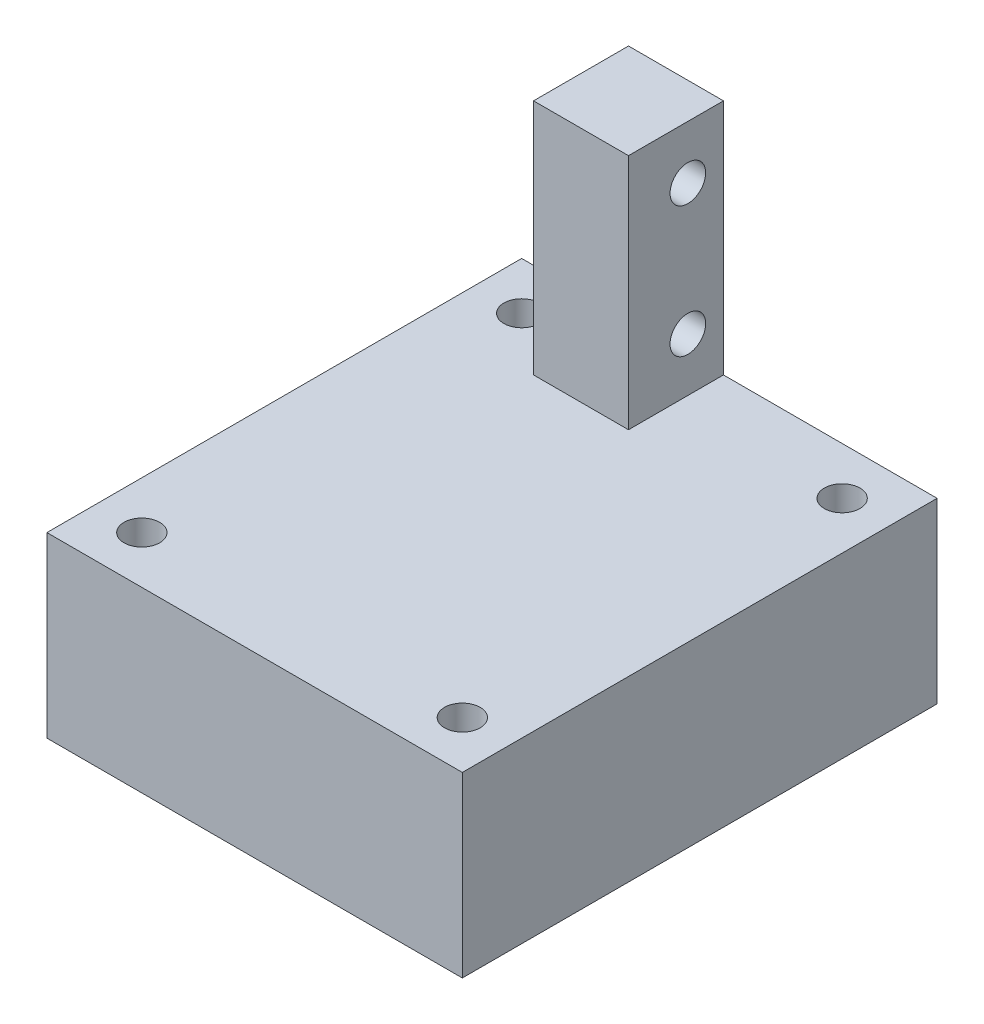
ISO-10303-21;
HEADER;
FILE_DESCRIPTION(('STEP AP214'),'2;1');
FILE_NAME('part.step','',(''),(''),'','','');
FILE_SCHEMA(('AUTOMOTIVE_DESIGN { 1 0 10303 214 1 1 1 1 }'));
ENDSEC;
DATA;
#1=APPLICATION_CONTEXT('core data for automotive mechanical design processes');
#2=APPLICATION_PROTOCOL_DEFINITION('international standard','automotive_design',2000,#1);
#3=PRODUCT_CONTEXT('',#1,'mechanical');
#4=PRODUCT('Part','Part','',(#3));
#5=PRODUCT_RELATED_PRODUCT_CATEGORY('part','',(#4));
#6=PRODUCT_DEFINITION_FORMATION('','',#4);
#7=PRODUCT_DEFINITION_CONTEXT('part definition',#1,'design');
#8=PRODUCT_DEFINITION('design','',#6,#7);
#9=PRODUCT_DEFINITION_SHAPE('','',#8);
#10=(LENGTH_UNIT() NAMED_UNIT(*) SI_UNIT(.MILLI.,.METRE.));
#11=(NAMED_UNIT(*) PLANE_ANGLE_UNIT() SI_UNIT($,.RADIAN.));
#12=(NAMED_UNIT(*) SI_UNIT($,.STERADIAN.) SOLID_ANGLE_UNIT());
#13=UNCERTAINTY_MEASURE_WITH_UNIT(LENGTH_MEASURE(1.E-05),#10,'distance_accuracy_value','');
#14=(GEOMETRIC_REPRESENTATION_CONTEXT(3) GLOBAL_UNCERTAINTY_ASSIGNED_CONTEXT((#13)) GLOBAL_UNIT_ASSIGNED_CONTEXT((#10,
#11,#12)) REPRESENTATION_CONTEXT('',''));
#15=CARTESIAN_POINT('',(0.,0.,0.));
#16=DIRECTION('',(0.,0.,1.));
#17=DIRECTION('',(1.,0.,0.));
#18=AXIS2_PLACEMENT_3D('',#15,#16,#17);
#19=CARTESIAN_POINT('',(0.,15.,0.));
#20=DIRECTION('',(0.,1.,0.));
#21=DIRECTION('',(0.,0.,1.));
#22=AXIS2_PLACEMENT_3D('',#19,#20,#21);
#23=PLANE('',#22);
#24=DIRECTION('',(0.,0.,1.));
#25=VECTOR('',#24,1.);
#26=CARTESIAN_POINT('',(-8.50000000000001,15.,-20.));
#27=LINE('',#26,#25);
#28=CARTESIAN_POINT('',(-8.50000000000001,15.,-20.));
#29=VERTEX_POINT('',#28);
#30=CARTESIAN_POINT('',(-8.50000000000001,15.,-12.));
#31=VERTEX_POINT('',#30);
#32=EDGE_CURVE('E62',#29,#31,#27,.T.);
#33=ORIENTED_EDGE('',*,*,#32,.F.);
#34=DIRECTION('',(-1.,0.,0.));
#35=VECTOR('',#34,1.);
#36=CARTESIAN_POINT('',(-17.5,15.,-20.));
#37=LINE('',#36,#35);
#38=CARTESIAN_POINT('',(-17.5,15.,-20.));
#39=VERTEX_POINT('',#38);
#40=EDGE_CURVE('E157',#29,#39,#37,.T.);
#41=ORIENTED_EDGE('',*,*,#40,.T.);
#42=DIRECTION('',(0.,0.,1.));
#43=VECTOR('',#42,1.);
#44=CARTESIAN_POINT('',(-17.5,15.,-20.));
#45=LINE('',#44,#43);
#46=CARTESIAN_POINT('',(-17.5,15.,20.));
#47=VERTEX_POINT('',#46);
#48=EDGE_CURVE('E162',#39,#47,#45,.T.);
#49=ORIENTED_EDGE('',*,*,#48,.T.);
#50=DIRECTION('',(1.,0.,0.));
#51=VECTOR('',#50,1.);
#52=CARTESIAN_POINT('',(-17.5,15.,20.));
#53=LINE('',#52,#51);
#54=CARTESIAN_POINT('',(17.5,15.,20.));
#55=VERTEX_POINT('',#54);
#56=EDGE_CURVE('E165',#47,#55,#53,.T.);
#57=ORIENTED_EDGE('',*,*,#56,.T.);
#58=DIRECTION('',(0.,0.,-1.));
#59=VECTOR('',#58,1.);
#60=CARTESIAN_POINT('',(17.5,15.,-20.));
#61=LINE('',#60,#59);
#62=CARTESIAN_POINT('',(17.5,15.,-20.));
#63=VERTEX_POINT('',#62);
#64=EDGE_CURVE('E153',#55,#63,#61,.T.);
#65=ORIENTED_EDGE('',*,*,#64,.T.);
#66=CARTESIAN_POINT('',(-0.500000000000007,15.,-20.));
#67=VERTEX_POINT('',#66);
#68=EDGE_CURVE('E159',#63,#67,#37,.T.);
#69=ORIENTED_EDGE('',*,*,#68,.T.);
#70=DIRECTION('',(0.,0.,-1.));
#71=VECTOR('',#70,1.);
#72=CARTESIAN_POINT('',(-0.500000000000007,15.,-20.));
#73=LINE('',#72,#71);
#74=CARTESIAN_POINT('',(-0.500000000000007,15.,-12.));
#75=VERTEX_POINT('',#74);
#76=EDGE_CURVE('E126',#75,#67,#73,.T.);
#77=ORIENTED_EDGE('',*,*,#76,.F.);
#78=DIRECTION('',(1.,0.,0.));
#79=VECTOR('',#78,1.);
#80=CARTESIAN_POINT('',(-8.50000000000001,15.,-12.));
#81=LINE('',#80,#79);
#82=EDGE_CURVE('E57',#31,#75,#81,.T.);
#83=ORIENTED_EDGE('',*,*,#82,.F.);
#84=EDGE_LOOP('',(#33,#41,#49,#57,#65,#69,#77,#83));
#85=FACE_BOUND('',#84,.T.);
#86=CARTESIAN_POINT('',(13.5,15.,-16.));
#87=DIRECTION('',(0.,1.,0.));
#88=DIRECTION('',(0.,0.,1.));
#89=AXIS2_PLACEMENT_3D('',#86,#87,#88);
#90=CIRCLE('',#89,1.50000000000001);
#91=CARTESIAN_POINT('',(13.5,15.,-14.5));
#92=VERTEX_POINT('',#91);
#93=EDGE_CURVE('E141',#92,#92,#90,.F.);
#94=ORIENTED_EDGE('',*,*,#93,.T.);
#95=EDGE_LOOP('',(#94));
#96=FACE_BOUND('',#95,.T.);
#97=CARTESIAN_POINT('',(-13.5,15.,-16.));
#98=DIRECTION('',(0.,1.,0.));
#99=DIRECTION('',(0.,0.,1.));
#100=AXIS2_PLACEMENT_3D('',#97,#98,#99);
#101=CIRCLE('',#100,1.50000000000001);
#102=CARTESIAN_POINT('',(-13.5,15.,-14.5));
#103=VERTEX_POINT('',#102);
#104=EDGE_CURVE('E145',#103,#103,#101,.F.);
#105=ORIENTED_EDGE('',*,*,#104,.T.);
#106=EDGE_LOOP('',(#105));
#107=FACE_BOUND('',#106,.T.);
#108=CARTESIAN_POINT('',(13.5,15.,16.));
#109=DIRECTION('',(0.,1.,0.));
#110=DIRECTION('',(0.,0.,1.));
#111=AXIS2_PLACEMENT_3D('',#108,#109,#110);
#112=CIRCLE('',#111,1.5);
#113=CARTESIAN_POINT('',(13.5,15.,17.5));
#114=VERTEX_POINT('',#113);
#115=EDGE_CURVE('E135',#114,#114,#112,.T.);
#116=ORIENTED_EDGE('',*,*,#115,.F.);
#117=EDGE_LOOP('',(#116));
#118=FACE_BOUND('',#117,.T.);
#119=CARTESIAN_POINT('',(-13.5,15.,16.));
#120=DIRECTION('',(0.,1.,0.));
#121=DIRECTION('',(0.,0.,1.));
#122=AXIS2_PLACEMENT_3D('',#119,#120,#121);
#123=CIRCLE('',#122,1.5);
#124=CARTESIAN_POINT('',(-13.5,15.,17.5));
#125=VERTEX_POINT('',#124);
#126=EDGE_CURVE('E130',#125,#125,#123,.T.);
#127=ORIENTED_EDGE('',*,*,#126,.F.);
#128=EDGE_LOOP('',(#127));
#129=FACE_BOUND('',#128,.T.);
#130=ADVANCED_FACE('F39',(#85,#96,#107,#118,#129),#23,.T.);
#131=CARTESIAN_POINT('',(0.,0.,0.));
#132=DIRECTION('',(0.,1.,0.));
#133=DIRECTION('',(0.,0.,1.));
#134=AXIS2_PLACEMENT_3D('',#131,#132,#133);
#135=PLANE('',#134);
#136=CARTESIAN_POINT('',(13.5,0.,16.));
#137=DIRECTION('',(0.,1.,0.));
#138=DIRECTION('',(0.,0.,1.));
#139=AXIS2_PLACEMENT_3D('',#136,#137,#138);
#140=CIRCLE('',#139,1.5);
#141=CARTESIAN_POINT('',(13.5,0.,17.5));
#142=VERTEX_POINT('',#141);
#143=EDGE_CURVE('E197',#142,#142,#140,.T.);
#144=ORIENTED_EDGE('',*,*,#143,.T.);
#145=EDGE_LOOP('',(#144));
#146=FACE_BOUND('',#145,.T.);
#147=CARTESIAN_POINT('',(13.5,0.,-16.));
#148=DIRECTION('',(0.,1.,0.));
#149=DIRECTION('',(0.,0.,1.));
#150=AXIS2_PLACEMENT_3D('',#147,#148,#149);
#151=CIRCLE('',#150,1.50000000000001);
#152=CARTESIAN_POINT('',(13.5,0.,-14.5));
#153=VERTEX_POINT('',#152);
#154=EDGE_CURVE('E194',#153,#153,#151,.F.);
#155=ORIENTED_EDGE('',*,*,#154,.F.);
#156=EDGE_LOOP('',(#155));
#157=FACE_BOUND('',#156,.T.);
#158=CARTESIAN_POINT('',(-13.5,0.,-16.));
#159=DIRECTION('',(0.,1.,0.));
#160=DIRECTION('',(0.,0.,1.));
#161=AXIS2_PLACEMENT_3D('',#158,#159,#160);
#162=CIRCLE('',#161,1.50000000000001);
#163=CARTESIAN_POINT('',(-13.5,0.,-14.5));
#164=VERTEX_POINT('',#163);
#165=EDGE_CURVE('E152',#164,#164,#162,.F.);
#166=ORIENTED_EDGE('',*,*,#165,.F.);
#167=EDGE_LOOP('',(#166));
#168=FACE_BOUND('',#167,.T.);
#169=DIRECTION('',(0.,0.,-1.));
#170=VECTOR('',#169,1.);
#171=CARTESIAN_POINT('',(17.5,0.,-20.));
#172=LINE('',#171,#170);
#173=CARTESIAN_POINT('',(17.5,0.,20.));
#174=VERTEX_POINT('',#173);
#175=CARTESIAN_POINT('',(17.5,0.,-20.));
#176=VERTEX_POINT('',#175);
#177=EDGE_CURVE('E169',#174,#176,#172,.T.);
#178=ORIENTED_EDGE('',*,*,#177,.F.);
#179=DIRECTION('',(1.,0.,0.));
#180=VECTOR('',#179,1.);
#181=CARTESIAN_POINT('',(-17.5,0.,20.));
#182=LINE('',#181,#180);
#183=CARTESIAN_POINT('',(-17.5,0.,20.));
#184=VERTEX_POINT('',#183);
#185=EDGE_CURVE('E158',#184,#174,#182,.T.);
#186=ORIENTED_EDGE('',*,*,#185,.F.);
#187=DIRECTION('',(0.,0.,1.));
#188=VECTOR('',#187,1.);
#189=CARTESIAN_POINT('',(-17.5,0.,-20.));
#190=LINE('',#189,#188);
#191=CARTESIAN_POINT('',(-17.5,0.,-20.));
#192=VERTEX_POINT('',#191);
#193=EDGE_CURVE('E176',#192,#184,#190,.T.);
#194=ORIENTED_EDGE('',*,*,#193,.F.);
#195=DIRECTION('',(-1.,0.,0.));
#196=VECTOR('',#195,1.);
#197=CARTESIAN_POINT('',(-17.5,0.,-20.));
#198=LINE('',#197,#196);
#199=EDGE_CURVE('E173',#176,#192,#198,.T.);
#200=ORIENTED_EDGE('',*,*,#199,.F.);
#201=EDGE_LOOP('',(#178,#186,#194,#200));
#202=FACE_BOUND('',#201,.T.);
#203=CARTESIAN_POINT('',(-13.5,0.,16.));
#204=DIRECTION('',(0.,1.,0.));
#205=DIRECTION('',(0.,0.,1.));
#206=AXIS2_PLACEMENT_3D('',#203,#204,#205);
#207=CIRCLE('',#206,1.5);
#208=CARTESIAN_POINT('',(-13.5,0.,17.5));
#209=VERTEX_POINT('',#208);
#210=EDGE_CURVE('E43',#209,#209,#207,.T.);
#211=ORIENTED_EDGE('',*,*,#210,.T.);
#212=EDGE_LOOP('',(#211));
#213=FACE_BOUND('',#212,.T.);
#214=ADVANCED_FACE('F206',(#146,#157,#168,#202,#213),#135,.F.);
#215=CARTESIAN_POINT('',(17.5,15.,-20.));
#216=DIRECTION('',(-1.,0.,0.));
#217=DIRECTION('',(0.,0.,1.));
#218=AXIS2_PLACEMENT_3D('',#215,#216,#217);
#219=PLANE('',#218);
#220=ORIENTED_EDGE('',*,*,#177,.T.);
#221=DIRECTION('',(0.,-1.,0.));
#222=VECTOR('',#221,1.);
#223=CARTESIAN_POINT('',(17.5,15.,-20.));
#224=LINE('',#223,#222);
#225=EDGE_CURVE('E11',#63,#176,#224,.T.);
#226=ORIENTED_EDGE('',*,*,#225,.F.);
#227=ORIENTED_EDGE('',*,*,#64,.F.);
#228=DIRECTION('',(0.,-1.,0.));
#229=VECTOR('',#228,1.);
#230=CARTESIAN_POINT('',(17.5,15.,20.));
#231=LINE('',#230,#229);
#232=EDGE_CURVE('E168',#55,#174,#231,.T.);
#233=ORIENTED_EDGE('',*,*,#232,.T.);
#234=EDGE_LOOP('',(#220,#226,#227,#233));
#235=FACE_BOUND('',#234,.T.);
#236=ADVANCED_FACE('F41',(#235),#219,.F.);
#237=CARTESIAN_POINT('',(-17.5,15.,-20.));
#238=DIRECTION('',(0.,0.,1.));
#239=DIRECTION('',(1.,0.,0.));
#240=AXIS2_PLACEMENT_3D('',#237,#238,#239);
#241=PLANE('',#240);
#242=ORIENTED_EDGE('',*,*,#199,.T.);
#243=DIRECTION('',(0.,-1.,0.));
#244=VECTOR('',#243,1.);
#245=CARTESIAN_POINT('',(-17.5,15.,-20.));
#246=LINE('',#245,#244);
#247=EDGE_CURVE('E49',#39,#192,#246,.T.);
#248=ORIENTED_EDGE('',*,*,#247,.F.);
#249=ORIENTED_EDGE('',*,*,#40,.F.);
#250=DIRECTION('',(0.,-1.,0.));
#251=VECTOR('',#250,1.);
#252=CARTESIAN_POINT('',(-8.50000000000001,35.,-20.));
#253=LINE('',#252,#251);
#254=CARTESIAN_POINT('',(-8.50000000000001,35.,-20.));
#255=VERTEX_POINT('',#254);
#256=EDGE_CURVE('E259',#255,#29,#253,.T.);
#257=ORIENTED_EDGE('',*,*,#256,.F.);
#258=DIRECTION('',(-1.,0.,0.));
#259=VECTOR('',#258,1.);
#260=CARTESIAN_POINT('',(-8.50000000000001,35.,-20.));
#261=LINE('',#260,#259);
#262=CARTESIAN_POINT('',(-0.500000000000007,35.,-20.));
#263=VERTEX_POINT('',#262);
#264=EDGE_CURVE('E121',#263,#255,#261,.T.);
#265=ORIENTED_EDGE('',*,*,#264,.F.);
#266=DIRECTION('',(0.,-1.,0.));
#267=VECTOR('',#266,1.);
#268=CARTESIAN_POINT('',(-0.500000000000007,35.,-20.));
#269=LINE('',#268,#267);
#270=EDGE_CURVE('E137',#263,#67,#269,.T.);
#271=ORIENTED_EDGE('',*,*,#270,.T.);
#272=ORIENTED_EDGE('',*,*,#68,.F.);
#273=ORIENTED_EDGE('',*,*,#225,.T.);
#274=EDGE_LOOP('',(#242,#248,#249,#257,#265,#271,#272,#273));
#275=FACE_BOUND('',#274,.T.);
#276=ADVANCED_FACE('F238',(#275),#241,.F.);
#277=CARTESIAN_POINT('',(-17.5,15.,-20.));
#278=DIRECTION('',(1.,0.,0.));
#279=DIRECTION('',(0.,0.,-1.));
#280=AXIS2_PLACEMENT_3D('',#277,#278,#279);
#281=PLANE('',#280);
#282=ORIENTED_EDGE('',*,*,#193,.T.);
#283=DIRECTION('',(0.,-1.,0.));
#284=VECTOR('',#283,1.);
#285=CARTESIAN_POINT('',(-17.5,15.,20.));
#286=LINE('',#285,#284);
#287=EDGE_CURVE('E184',#47,#184,#286,.T.);
#288=ORIENTED_EDGE('',*,*,#287,.F.);
#289=ORIENTED_EDGE('',*,*,#48,.F.);
#290=ORIENTED_EDGE('',*,*,#247,.T.);
#291=EDGE_LOOP('',(#282,#288,#289,#290));
#292=FACE_BOUND('',#291,.T.);
#293=ADVANCED_FACE('F235',(#292),#281,.F.);
#294=CARTESIAN_POINT('',(-17.5,15.,20.));
#295=DIRECTION('',(0.,0.,-1.));
#296=DIRECTION('',(-1.,0.,0.));
#297=AXIS2_PLACEMENT_3D('',#294,#295,#296);
#298=PLANE('',#297);
#299=ORIENTED_EDGE('',*,*,#185,.T.);
#300=ORIENTED_EDGE('',*,*,#232,.F.);
#301=ORIENTED_EDGE('',*,*,#56,.F.);
#302=ORIENTED_EDGE('',*,*,#287,.T.);
#303=EDGE_LOOP('',(#299,#300,#301,#302));
#304=FACE_BOUND('',#303,.T.);
#305=ADVANCED_FACE('F232',(#304),#298,.F.);
#306=CARTESIAN_POINT('',(-13.5,-10.,-16.));
#307=DIRECTION('',(0.,1.,0.));
#308=DIRECTION('',(0.,0.,1.));
#309=AXIS2_PLACEMENT_3D('',#306,#307,#308);
#310=CYLINDRICAL_SURFACE('',#309,1.50000000000001);
#311=ORIENTED_EDGE('',*,*,#104,.F.);
#312=EDGE_LOOP('',(#311));
#313=FACE_BOUND('',#312,.T.);
#314=ORIENTED_EDGE('',*,*,#165,.T.);
#315=EDGE_LOOP('',(#314));
#316=FACE_BOUND('',#315,.T.);
#317=ADVANCED_FACE('F230',(#313,#316),#310,.F.);
#318=CARTESIAN_POINT('',(13.5,-10.,-16.));
#319=DIRECTION('',(0.,1.,0.));
#320=DIRECTION('',(0.,0.,1.));
#321=AXIS2_PLACEMENT_3D('',#318,#319,#320);
#322=CYLINDRICAL_SURFACE('',#321,1.50000000000001);
#323=ORIENTED_EDGE('',*,*,#93,.F.);
#324=EDGE_LOOP('',(#323));
#325=FACE_BOUND('',#324,.T.);
#326=ORIENTED_EDGE('',*,*,#154,.T.);
#327=EDGE_LOOP('',(#326));
#328=FACE_BOUND('',#327,.T.);
#329=ADVANCED_FACE('F219',(#325,#328),#322,.F.);
#330=CARTESIAN_POINT('',(13.5,-10.,16.));
#331=DIRECTION('',(0.,1.,0.));
#332=DIRECTION('',(0.,0.,1.));
#333=AXIS2_PLACEMENT_3D('',#330,#331,#332);
#334=CYLINDRICAL_SURFACE('',#333,1.5);
#335=ORIENTED_EDGE('',*,*,#115,.T.);
#336=EDGE_LOOP('',(#335));
#337=FACE_BOUND('',#336,.T.);
#338=ORIENTED_EDGE('',*,*,#143,.F.);
#339=EDGE_LOOP('',(#338));
#340=FACE_BOUND('',#339,.T.);
#341=ADVANCED_FACE('F210',(#337,#340),#334,.F.);
#342=CARTESIAN_POINT('',(-13.5,-10.,16.));
#343=DIRECTION('',(0.,1.,0.));
#344=DIRECTION('',(0.,0.,1.));
#345=AXIS2_PLACEMENT_3D('',#342,#343,#344);
#346=CYLINDRICAL_SURFACE('',#345,1.5);
#347=ORIENTED_EDGE('',*,*,#126,.T.);
#348=EDGE_LOOP('',(#347));
#349=FACE_BOUND('',#348,.T.);
#350=ORIENTED_EDGE('',*,*,#210,.F.);
#351=EDGE_LOOP('',(#350));
#352=FACE_BOUND('',#351,.T.);
#353=ADVANCED_FACE('F208',(#349,#352),#346,.F.);
#354=CARTESIAN_POINT('',(-8.50000000000001,35.,-20.));
#355=DIRECTION('',(1.,0.,0.));
#356=DIRECTION('',(0.,0.,-1.));
#357=AXIS2_PLACEMENT_3D('',#354,#355,#356);
#358=PLANE('',#357);
#359=CARTESIAN_POINT('',(-8.50000000000001,30.5,-17.));
#360=DIRECTION('',(1.,0.,0.));
#361=DIRECTION('',(0.,0.,-1.));
#362=AXIS2_PLACEMENT_3D('',#359,#360,#361);
#363=CIRCLE('',#362,1.5);
#364=CARTESIAN_POINT('',(-8.50000000000001,30.5,-18.5));
#365=VERTEX_POINT('',#364);
#366=EDGE_CURVE('E272',#365,#365,#363,.T.);
#367=ORIENTED_EDGE('',*,*,#366,.T.);
#368=EDGE_LOOP('',(#367));
#369=FACE_BOUND('',#368,.T.);
#370=CARTESIAN_POINT('',(-8.50000000000001,19.5,-17.));
#371=DIRECTION('',(1.,0.,0.));
#372=DIRECTION('',(0.,0.,-1.));
#373=AXIS2_PLACEMENT_3D('',#370,#371,#372);
#374=CIRCLE('',#373,1.5);
#375=CARTESIAN_POINT('',(-8.50000000000001,19.5,-18.5));
#376=VERTEX_POINT('',#375);
#377=EDGE_CURVE('E279',#376,#376,#374,.T.);
#378=ORIENTED_EDGE('',*,*,#377,.T.);
#379=EDGE_LOOP('',(#378));
#380=FACE_BOUND('',#379,.T.);
#381=ORIENTED_EDGE('',*,*,#32,.T.);
#382=DIRECTION('',(0.,-1.,0.));
#383=VECTOR('',#382,1.);
#384=CARTESIAN_POINT('',(-8.50000000000001,35.,-12.));
#385=LINE('',#384,#383);
#386=CARTESIAN_POINT('',(-8.50000000000001,35.,-12.));
#387=VERTEX_POINT('',#386);
#388=EDGE_CURVE('E109',#387,#31,#385,.T.);
#389=ORIENTED_EDGE('',*,*,#388,.F.);
#390=DIRECTION('',(0.,0.,1.));
#391=VECTOR('',#390,1.);
#392=CARTESIAN_POINT('',(-8.50000000000001,35.,-20.));
#393=LINE('',#392,#391);
#394=EDGE_CURVE('E116',#255,#387,#393,.T.);
#395=ORIENTED_EDGE('',*,*,#394,.F.);
#396=ORIENTED_EDGE('',*,*,#256,.T.);
#397=EDGE_LOOP('',(#381,#389,#395,#396));
#398=FACE_BOUND('',#397,.T.);
#399=ADVANCED_FACE('F128',(#369,#380,#398),#358,.F.);
#400=CARTESIAN_POINT('',(-8.50000000000001,35.,-12.));
#401=DIRECTION('',(0.,0.,-1.));
#402=DIRECTION('',(-1.,0.,0.));
#403=AXIS2_PLACEMENT_3D('',#400,#401,#402);
#404=PLANE('',#403);
#405=ORIENTED_EDGE('',*,*,#82,.T.);
#406=DIRECTION('',(0.,-1.,0.));
#407=VECTOR('',#406,1.);
#408=CARTESIAN_POINT('',(-0.500000000000007,35.,-12.));
#409=LINE('',#408,#407);
#410=CARTESIAN_POINT('',(-0.500000000000007,35.,-12.));
#411=VERTEX_POINT('',#410);
#412=EDGE_CURVE('E111',#411,#75,#409,.T.);
#413=ORIENTED_EDGE('',*,*,#412,.F.);
#414=DIRECTION('',(1.,0.,0.));
#415=VECTOR('',#414,1.);
#416=CARTESIAN_POINT('',(-8.50000000000001,35.,-12.));
#417=LINE('',#416,#415);
#418=EDGE_CURVE('E105',#387,#411,#417,.T.);
#419=ORIENTED_EDGE('',*,*,#418,.F.);
#420=ORIENTED_EDGE('',*,*,#388,.T.);
#421=EDGE_LOOP('',(#405,#413,#419,#420));
#422=FACE_BOUND('',#421,.T.);
#423=ADVANCED_FACE('F107',(#422),#404,.F.);
#424=CARTESIAN_POINT('',(-0.500000000000007,35.,-20.));
#425=DIRECTION('',(-1.,0.,0.));
#426=DIRECTION('',(0.,0.,1.));
#427=AXIS2_PLACEMENT_3D('',#424,#425,#426);
#428=PLANE('',#427);
#429=CARTESIAN_POINT('',(-0.500000000000007,30.5,-17.));
#430=DIRECTION('',(1.,0.,0.));
#431=DIRECTION('',(0.,0.,-1.));
#432=AXIS2_PLACEMENT_3D('',#429,#430,#431);
#433=CIRCLE('',#432,1.5);
#434=CARTESIAN_POINT('',(-0.500000000000007,30.5,-18.5));
#435=VERTEX_POINT('',#434);
#436=EDGE_CURVE('E283',#435,#435,#433,.T.);
#437=ORIENTED_EDGE('',*,*,#436,.F.);
#438=EDGE_LOOP('',(#437));
#439=FACE_BOUND('',#438,.T.);
#440=CARTESIAN_POINT('',(-0.500000000000007,19.5,-17.));
#441=DIRECTION('',(1.,0.,0.));
#442=DIRECTION('',(0.,0.,-1.));
#443=AXIS2_PLACEMENT_3D('',#440,#441,#442);
#444=CIRCLE('',#443,1.5);
#445=CARTESIAN_POINT('',(-0.500000000000007,19.5,-18.5));
#446=VERTEX_POINT('',#445);
#447=EDGE_CURVE('E284',#446,#446,#444,.T.);
#448=ORIENTED_EDGE('',*,*,#447,.F.);
#449=EDGE_LOOP('',(#448));
#450=FACE_BOUND('',#449,.T.);
#451=ORIENTED_EDGE('',*,*,#76,.T.);
#452=ORIENTED_EDGE('',*,*,#270,.F.);
#453=DIRECTION('',(0.,0.,-1.));
#454=VECTOR('',#453,1.);
#455=CARTESIAN_POINT('',(-0.500000000000007,35.,-20.));
#456=LINE('',#455,#454);
#457=EDGE_CURVE('E115',#411,#263,#456,.T.);
#458=ORIENTED_EDGE('',*,*,#457,.F.);
#459=ORIENTED_EDGE('',*,*,#412,.T.);
#460=EDGE_LOOP('',(#451,#452,#458,#459));
#461=FACE_BOUND('',#460,.T.);
#462=ADVANCED_FACE('F295',(#439,#450,#461),#428,.F.);
#463=CARTESIAN_POINT('',(0.,35.,0.));
#464=DIRECTION('',(0.,1.,0.));
#465=DIRECTION('',(0.,0.,1.));
#466=AXIS2_PLACEMENT_3D('',#463,#464,#465);
#467=PLANE('',#466);
#468=ORIENTED_EDGE('',*,*,#394,.T.);
#469=ORIENTED_EDGE('',*,*,#418,.T.);
#470=ORIENTED_EDGE('',*,*,#457,.T.);
#471=ORIENTED_EDGE('',*,*,#264,.T.);
#472=EDGE_LOOP('',(#468,#469,#470,#471));
#473=FACE_BOUND('',#472,.T.);
#474=ADVANCED_FACE('F119',(#473),#467,.T.);
#475=CARTESIAN_POINT('',(-20.5,19.5,-17.));
#476=DIRECTION('',(1.,0.,0.));
#477=DIRECTION('',(0.,0.,-1.));
#478=AXIS2_PLACEMENT_3D('',#475,#476,#477);
#479=CYLINDRICAL_SURFACE('',#478,1.5);
#480=ORIENTED_EDGE('',*,*,#447,.T.);
#481=EDGE_LOOP('',(#480));
#482=FACE_BOUND('',#481,.T.);
#483=ORIENTED_EDGE('',*,*,#377,.F.);
#484=EDGE_LOOP('',(#483));
#485=FACE_BOUND('',#484,.T.);
#486=ADVANCED_FACE('F303',(#482,#485),#479,.F.);
#487=CARTESIAN_POINT('',(-20.5,30.5,-17.));
#488=DIRECTION('',(1.,0.,0.));
#489=DIRECTION('',(0.,0.,-1.));
#490=AXIS2_PLACEMENT_3D('',#487,#488,#489);
#491=CYLINDRICAL_SURFACE('',#490,1.5);
#492=ORIENTED_EDGE('',*,*,#436,.T.);
#493=EDGE_LOOP('',(#492));
#494=FACE_BOUND('',#493,.T.);
#495=ORIENTED_EDGE('',*,*,#366,.F.);
#496=EDGE_LOOP('',(#495));
#497=FACE_BOUND('',#496,.T.);
#498=ADVANCED_FACE('F292',(#494,#497),#491,.F.);
#499=CLOSED_SHELL('',(#130,#214,#236,#276,#293,#305,#317,#329,#341,#353,#399,#423,#462,#474,
#486,#498));
#500=MANIFOLD_SOLID_BREP('B2',#499);
#501=ADVANCED_BREP_SHAPE_REPRESENTATION('',(#18,#500),#14);
#502=SHAPE_DEFINITION_REPRESENTATION(#9,#501);
ENDSEC;
END-ISO-10303-21;
